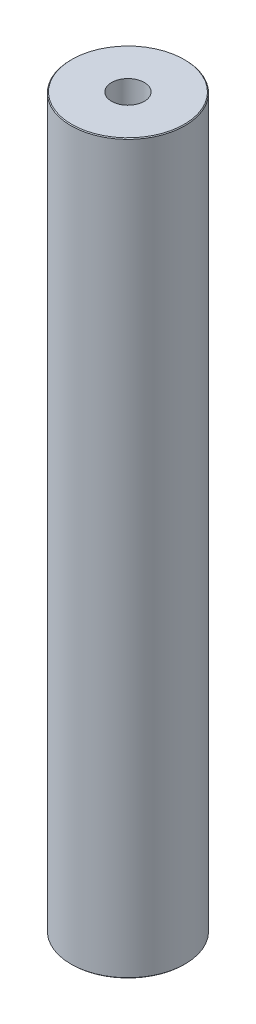
ISO-10303-21;
HEADER;
FILE_DESCRIPTION(('STEP AP214'),'2;1');
FILE_NAME('part.step','',(''),(''),'','','');
FILE_SCHEMA(('AUTOMOTIVE_DESIGN { 1 0 10303 214 1 1 1 1 }'));
ENDSEC;
DATA;
#1=APPLICATION_CONTEXT('core data for automotive mechanical design processes');
#2=APPLICATION_PROTOCOL_DEFINITION('international standard','automotive_design',2000,#1);
#3=PRODUCT_CONTEXT('',#1,'mechanical');
#4=PRODUCT('Part','Part','',(#3));
#5=PRODUCT_RELATED_PRODUCT_CATEGORY('part','',(#4));
#6=PRODUCT_DEFINITION_FORMATION('','',#4);
#7=PRODUCT_DEFINITION_CONTEXT('part definition',#1,'design');
#8=PRODUCT_DEFINITION('design','',#6,#7);
#9=PRODUCT_DEFINITION_SHAPE('','',#8);
#10=(LENGTH_UNIT() NAMED_UNIT(*) SI_UNIT(.MILLI.,.METRE.));
#11=(NAMED_UNIT(*) PLANE_ANGLE_UNIT() SI_UNIT($,.RADIAN.));
#12=(NAMED_UNIT(*) SI_UNIT($,.STERADIAN.) SOLID_ANGLE_UNIT());
#13=UNCERTAINTY_MEASURE_WITH_UNIT(LENGTH_MEASURE(1.E-05),#10,'distance_accuracy_value','');
#14=(GEOMETRIC_REPRESENTATION_CONTEXT(3) GLOBAL_UNCERTAINTY_ASSIGNED_CONTEXT((#13)) GLOBAL_UNIT_ASSIGNED_CONTEXT((#10,
#11,#12)) REPRESENTATION_CONTEXT('',''));
#15=CARTESIAN_POINT('',(0.,0.,0.));
#16=DIRECTION('',(0.,0.,1.));
#17=DIRECTION('',(1.,0.,0.));
#18=AXIS2_PLACEMENT_3D('',#15,#16,#17);
#19=CARTESIAN_POINT('',(0.,542.32536373348,0.));
#20=DIRECTION('',(0.,-1.,0.));
#21=DIRECTION('',(0.,0.,-1.));
#22=AXIS2_PLACEMENT_3D('',#19,#20,#21);
#23=CYLINDRICAL_SURFACE('',#22,42.5);
#24=CARTESIAN_POINT('',(0.,541.733489409333,0.));
#25=DIRECTION('',(0.,1.,0.));
#26=DIRECTION('',(0.,0.,1.));
#27=AXIS2_PLACEMENT_3D('',#24,#25,#26);
#28=CIRCLE('',#27,42.5);
#29=CARTESIAN_POINT('',(0.,541.733489409333,42.5));
#30=VERTEX_POINT('',#29);
#31=EDGE_CURVE('E50',#30,#30,#28,.F.);
#32=ORIENTED_EDGE('',*,*,#31,.T.);
#33=EDGE_LOOP('',(#32));
#34=FACE_BOUND('',#33,.T.);
#35=CARTESIAN_POINT('',(0.,0.591874324146424,0.));
#36=DIRECTION('',(0.,1.,0.));
#37=DIRECTION('',(0.,0.,1.));
#38=AXIS2_PLACEMENT_3D('',#35,#36,#37);
#39=CIRCLE('',#38,42.5);
#40=CARTESIAN_POINT('',(0.,0.591874324146424,42.5));
#41=VERTEX_POINT('',#40);
#42=EDGE_CURVE('E51',#41,#41,#39,.T.);
#43=ORIENTED_EDGE('',*,*,#42,.T.);
#44=EDGE_LOOP('',(#43));
#45=FACE_BOUND('',#44,.T.);
#46=ADVANCED_FACE('F39',(#34,#45),#23,.T.);
#47=CARTESIAN_POINT('',(0.,542.32536373348,0.));
#48=DIRECTION('',(0.,1.,0.));
#49=DIRECTION('',(0.,0.,1.));
#50=AXIS2_PLACEMENT_3D('',#47,#48,#49);
#51=PLANE('',#50);
#52=CARTESIAN_POINT('',(0.,542.32536373348,0.));
#53=DIRECTION('',(0.,1.,0.));
#54=DIRECTION('',(0.,0.,1.));
#55=AXIS2_PLACEMENT_3D('',#52,#53,#54);
#56=CIRCLE('',#55,41.9081256758536);
#57=CARTESIAN_POINT('',(0.,542.32536373348,41.9081256758536));
#58=VERTEX_POINT('',#57);
#59=EDGE_CURVE('E54',#58,#58,#56,.T.);
#60=ORIENTED_EDGE('',*,*,#59,.T.);
#61=EDGE_LOOP('',(#60));
#62=FACE_BOUND('',#61,.T.);
#63=CARTESIAN_POINT('',(0.,542.32536373348,0.));
#64=DIRECTION('',(0.,1.,0.));
#65=DIRECTION('',(0.,0.,1.));
#66=AXIS2_PLACEMENT_3D('',#63,#64,#65);
#67=CIRCLE('',#66,12.2006838148279);
#68=CARTESIAN_POINT('',(0.,542.32536373348,12.2006838148279));
#69=VERTEX_POINT('',#68);
#70=EDGE_CURVE('E58',#69,#69,#67,.T.);
#71=ORIENTED_EDGE('',*,*,#70,.F.);
#72=EDGE_LOOP('',(#71));
#73=FACE_BOUND('',#72,.T.);
#74=ADVANCED_FACE('F69',(#62,#73),#51,.T.);
#75=CARTESIAN_POINT('',(0.,0.,0.));
#76=DIRECTION('',(0.,1.,0.));
#77=DIRECTION('',(0.,0.,1.));
#78=AXIS2_PLACEMENT_3D('',#75,#76,#77);
#79=PLANE('',#78);
#80=CARTESIAN_POINT('',(0.,0.,0.));
#81=DIRECTION('',(0.,1.,0.));
#82=DIRECTION('',(0.,0.,1.));
#83=AXIS2_PLACEMENT_3D('',#80,#81,#82);
#84=CIRCLE('',#83,41.9081256758536);
#85=CARTESIAN_POINT('',(0.,0.,41.9081256758536));
#86=VERTEX_POINT('',#85);
#87=EDGE_CURVE('E10',#86,#86,#84,.F.);
#88=ORIENTED_EDGE('',*,*,#87,.T.);
#89=EDGE_LOOP('',(#88));
#90=FACE_BOUND('',#89,.T.);
#91=CARTESIAN_POINT('',(0.,0.,0.));
#92=DIRECTION('',(0.,1.,0.));
#93=DIRECTION('',(0.,0.,1.));
#94=AXIS2_PLACEMENT_3D('',#91,#92,#93);
#95=CIRCLE('',#94,12.2006838148279);
#96=CARTESIAN_POINT('',(0.,0.,12.2006838148279));
#97=VERTEX_POINT('',#96);
#98=EDGE_CURVE('E63',#97,#97,#95,.T.);
#99=ORIENTED_EDGE('',*,*,#98,.T.);
#100=EDGE_LOOP('',(#99));
#101=FACE_BOUND('',#100,.T.);
#102=ADVANCED_FACE('F75',(#90,#101),#79,.F.);
#103=CARTESIAN_POINT('',(0.,542.32536373348,0.));
#104=DIRECTION('',(0.,-1.,0.));
#105=DIRECTION('',(0.,0.,-1.));
#106=AXIS2_PLACEMENT_3D('',#103,#104,#105);
#107=CYLINDRICAL_SURFACE('',#106,12.2006838148279);
#108=ORIENTED_EDGE('',*,*,#70,.T.);
#109=EDGE_LOOP('',(#108));
#110=FACE_BOUND('',#109,.T.);
#111=ORIENTED_EDGE('',*,*,#98,.F.);
#112=EDGE_LOOP('',(#111));
#113=FACE_BOUND('',#112,.T.);
#114=ADVANCED_FACE('F70',(#110,#113),#107,.F.);
#115=CARTESIAN_POINT('',(0.,542.32536373348,0.));
#116=DIRECTION('',(0.,-1.,0.));
#117=DIRECTION('',(0.,0.,-1.));
#118=AXIS2_PLACEMENT_3D('',#115,#116,#117);
#119=CONICAL_SURFACE('',#118,41.9081256758536,0.785398163397472);
#120=ORIENTED_EDGE('',*,*,#31,.F.);
#121=EDGE_LOOP('',(#120));
#122=FACE_BOUND('',#121,.T.);
#123=ORIENTED_EDGE('',*,*,#59,.F.);
#124=EDGE_LOOP('',(#123));
#125=FACE_BOUND('',#124,.T.);
#126=ADVANCED_FACE('F81',(#122,#125),#119,.T.);
#127=CARTESIAN_POINT('',(0.,0.591874324146424,0.));
#128=DIRECTION('',(0.,1.,0.));
#129=DIRECTION('',(0.,0.,1.));
#130=AXIS2_PLACEMENT_3D('',#127,#128,#129);
#131=CONICAL_SURFACE('',#130,42.5,0.785398163397425);
#132=ORIENTED_EDGE('',*,*,#87,.F.);
#133=EDGE_LOOP('',(#132));
#134=FACE_BOUND('',#133,.T.);
#135=ORIENTED_EDGE('',*,*,#42,.F.);
#136=EDGE_LOOP('',(#135));
#137=FACE_BOUND('',#136,.T.);
#138=ADVANCED_FACE('F45',(#134,#137),#131,.T.);
#139=CLOSED_SHELL('',(#46,#74,#102,#114,#126,#138));
#140=MANIFOLD_SOLID_BREP('B2',#139);
#141=ADVANCED_BREP_SHAPE_REPRESENTATION('',(#18,#140),#14);
#142=SHAPE_DEFINITION_REPRESENTATION(#9,#141);
ENDSEC;
END-ISO-10303-21;
